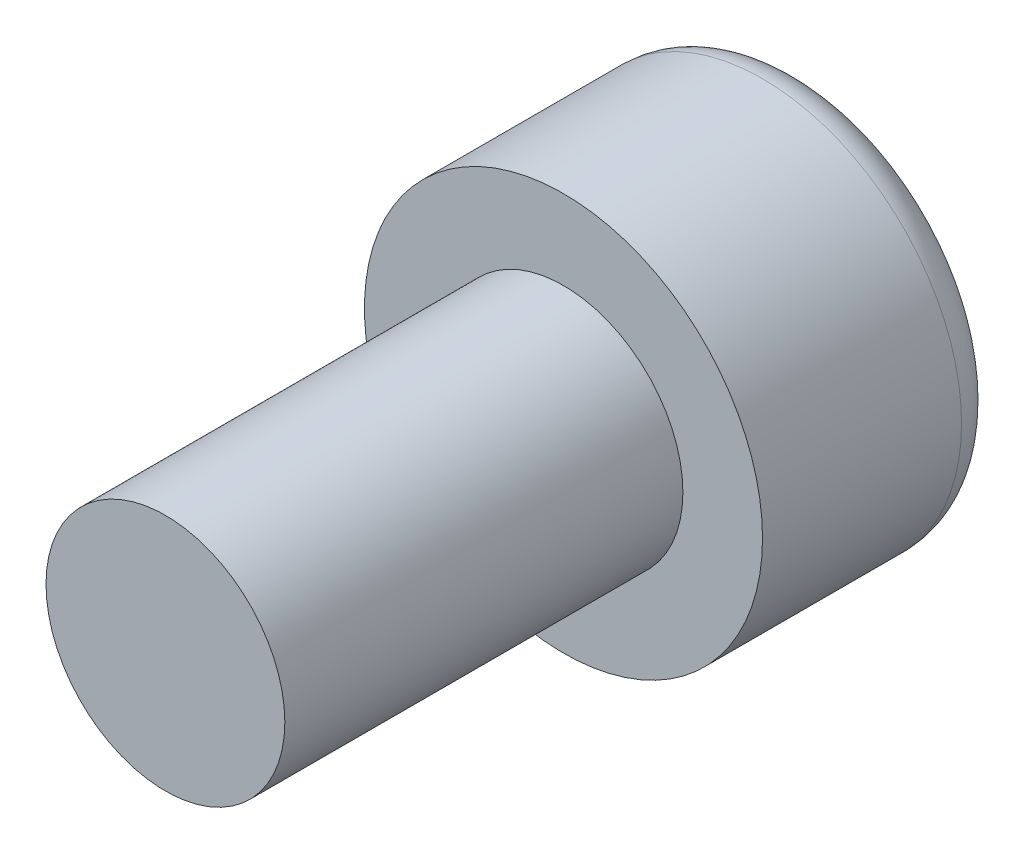
ISO-10303-21;
HEADER;
FILE_DESCRIPTION(('STEP AP214'),'2;1');
FILE_NAME('part.step','',(''),(''),'','','');
FILE_SCHEMA(('AUTOMOTIVE_DESIGN { 1 0 10303 214 1 1 1 1 }'));
ENDSEC;
DATA;
#1=APPLICATION_CONTEXT('core data for automotive mechanical design processes');
#2=APPLICATION_PROTOCOL_DEFINITION('international standard','automotive_design',2000,#1);
#3=PRODUCT_CONTEXT('',#1,'mechanical');
#4=PRODUCT('Part','Part','',(#3));
#5=PRODUCT_RELATED_PRODUCT_CATEGORY('part','',(#4));
#6=PRODUCT_DEFINITION_FORMATION('','',#4);
#7=PRODUCT_DEFINITION_CONTEXT('part definition',#1,'design');
#8=PRODUCT_DEFINITION('design','',#6,#7);
#9=PRODUCT_DEFINITION_SHAPE('','',#8);
#10=(LENGTH_UNIT() NAMED_UNIT(*) SI_UNIT(.MILLI.,.METRE.));
#11=(NAMED_UNIT(*) PLANE_ANGLE_UNIT() SI_UNIT($,.RADIAN.));
#12=(NAMED_UNIT(*) SI_UNIT($,.STERADIAN.) SOLID_ANGLE_UNIT());
#13=UNCERTAINTY_MEASURE_WITH_UNIT(LENGTH_MEASURE(1.E-05),#10,'distance_accuracy_value','');
#14=(GEOMETRIC_REPRESENTATION_CONTEXT(3) GLOBAL_UNCERTAINTY_ASSIGNED_CONTEXT((#13)) GLOBAL_UNIT_ASSIGNED_CONTEXT((#10,
#11,#12)) REPRESENTATION_CONTEXT('',''));
#15=CARTESIAN_POINT('',(0.,0.,0.));
#16=DIRECTION('',(0.,0.,1.));
#17=DIRECTION('',(1.,0.,0.));
#18=AXIS2_PLACEMENT_3D('',#15,#16,#17);
#19=CARTESIAN_POINT('',(0.,0.,6.));
#20=DIRECTION('',(0.,0.,-1.));
#21=DIRECTION('',(-1.,0.,0.));
#22=AXIS2_PLACEMENT_3D('',#19,#20,#21);
#23=CYLINDRICAL_SURFACE('',#22,5.);
#24=CARTESIAN_POINT('',(0.,0.,1.));
#25=DIRECTION('',(0.,0.,1.));
#26=DIRECTION('',(1.,0.,0.));
#27=AXIS2_PLACEMENT_3D('',#24,#25,#26);
#28=CIRCLE('',#27,5.);
#29=CARTESIAN_POINT('',(5.,0.,1.));
#30=VERTEX_POINT('',#29);
#31=EDGE_CURVE('E42',#30,#30,#28,.T.);
#32=ORIENTED_EDGE('',*,*,#31,.T.);
#33=EDGE_LOOP('',(#32));
#34=FACE_BOUND('',#33,.T.);
#35=CARTESIAN_POINT('',(0.,0.,6.));
#36=DIRECTION('',(0.,0.,1.));
#37=DIRECTION('',(1.,0.,0.));
#38=AXIS2_PLACEMENT_3D('',#35,#36,#37);
#39=CIRCLE('',#38,5.);
#40=CARTESIAN_POINT('',(5.,0.,6.));
#41=VERTEX_POINT('',#40);
#42=EDGE_CURVE('E144',#41,#41,#39,.T.);
#43=ORIENTED_EDGE('',*,*,#42,.F.);
#44=EDGE_LOOP('',(#43));
#45=FACE_BOUND('',#44,.T.);
#46=ADVANCED_FACE('F34',(#34,#45),#23,.T.);
#47=CARTESIAN_POINT('',(0.,0.,6.));
#48=DIRECTION('',(0.,0.,1.));
#49=DIRECTION('',(1.,0.,0.));
#50=AXIS2_PLACEMENT_3D('',#47,#48,#49);
#51=PLANE('',#50);
#52=CARTESIAN_POINT('',(0.,0.,6.));
#53=DIRECTION('',(0.,0.,1.));
#54=DIRECTION('',(1.,0.,0.));
#55=AXIS2_PLACEMENT_3D('',#52,#53,#54);
#56=CIRCLE('',#55,3.);
#57=CARTESIAN_POINT('',(3.,0.,6.));
#58=VERTEX_POINT('',#57);
#59=EDGE_CURVE('E145',#58,#58,#56,.T.);
#60=ORIENTED_EDGE('',*,*,#59,.F.);
#61=EDGE_LOOP('',(#60));
#62=FACE_BOUND('',#61,.T.);
#63=ORIENTED_EDGE('',*,*,#42,.T.);
#64=EDGE_LOOP('',(#63));
#65=FACE_BOUND('',#64,.T.);
#66=ADVANCED_FACE('F163',(#62,#65),#51,.T.);
#67=CARTESIAN_POINT('',(0.,0.,0.));
#68=DIRECTION('',(0.,0.,1.));
#69=DIRECTION('',(1.,0.,0.));
#70=AXIS2_PLACEMENT_3D('',#67,#68,#69);
#71=PLANE('',#70);
#72=CARTESIAN_POINT('',(0.,0.,0.));
#73=DIRECTION('',(0.,0.,1.));
#74=DIRECTION('',(1.,0.,0.));
#75=AXIS2_PLACEMENT_3D('',#72,#73,#74);
#76=CIRCLE('',#75,4.);
#77=CARTESIAN_POINT('',(4.,0.,0.));
#78=VERTEX_POINT('',#77);
#79=EDGE_CURVE('E11',#78,#78,#76,.F.);
#80=ORIENTED_EDGE('',*,*,#79,.T.);
#81=EDGE_LOOP('',(#80));
#82=FACE_BOUND('',#81,.T.);
#83=DIRECTION('',(-0.866025403784438,-0.5,0.));
#84=VECTOR('',#83,1.);
#85=CARTESIAN_POINT('',(2.5,-1.44337567297407,0.));
#86=LINE('',#85,#84);
#87=CARTESIAN_POINT('',(2.5,-1.44337567297407,0.));
#88=VERTEX_POINT('',#87);
#89=CARTESIAN_POINT('',(0.,-2.88675134594813,0.));
#90=VERTEX_POINT('',#89);
#91=EDGE_CURVE('E123',#88,#90,#86,.T.);
#92=ORIENTED_EDGE('',*,*,#91,.F.);
#93=DIRECTION('',(0.,-1.,0.));
#94=VECTOR('',#93,1.);
#95=CARTESIAN_POINT('',(2.5,1.44337567297406,0.));
#96=LINE('',#95,#94);
#97=CARTESIAN_POINT('',(2.5,1.44337567297406,0.));
#98=VERTEX_POINT('',#97);
#99=EDGE_CURVE('E49',#98,#88,#96,.T.);
#100=ORIENTED_EDGE('',*,*,#99,.F.);
#101=DIRECTION('',(0.866025403784439,-0.5,0.));
#102=VECTOR('',#101,1.);
#103=CARTESIAN_POINT('',(0.,2.88675134594813,0.));
#104=LINE('',#103,#102);
#105=CARTESIAN_POINT('',(0.,2.88675134594813,0.));
#106=VERTEX_POINT('',#105);
#107=EDGE_CURVE('E132',#106,#98,#104,.T.);
#108=ORIENTED_EDGE('',*,*,#107,.F.);
#109=DIRECTION('',(0.866025403784439,0.5,0.));
#110=VECTOR('',#109,1.);
#111=CARTESIAN_POINT('',(-2.5,1.44337567297407,0.));
#112=LINE('',#111,#110);
#113=CARTESIAN_POINT('',(-2.5,1.44337567297407,0.));
#114=VERTEX_POINT('',#113);
#115=EDGE_CURVE('E130',#114,#106,#112,.T.);
#116=ORIENTED_EDGE('',*,*,#115,.F.);
#117=DIRECTION('',(0.,1.,0.));
#118=VECTOR('',#117,1.);
#119=CARTESIAN_POINT('',(-2.5,-1.44337567297406,0.));
#120=LINE('',#119,#118);
#121=CARTESIAN_POINT('',(-2.5,-1.44337567297406,0.));
#122=VERTEX_POINT('',#121);
#123=EDGE_CURVE('E97',#122,#114,#120,.T.);
#124=ORIENTED_EDGE('',*,*,#123,.F.);
#125=DIRECTION('',(-0.866025403784439,0.5,0.));
#126=VECTOR('',#125,1.);
#127=CARTESIAN_POINT('',(0.,-2.88675134594813,0.));
#128=LINE('',#127,#126);
#129=EDGE_CURVE('E126',#90,#122,#128,.T.);
#130=ORIENTED_EDGE('',*,*,#129,.F.);
#131=EDGE_LOOP('',(#92,#100,#108,#116,#124,#130));
#132=FACE_BOUND('',#131,.T.);
#133=ADVANCED_FACE('F167',(#82,#132),#71,.F.);
#134=CARTESIAN_POINT('',(0.,0.,16.));
#135=DIRECTION('',(0.,0.,-1.));
#136=DIRECTION('',(-1.,0.,0.));
#137=AXIS2_PLACEMENT_3D('',#134,#135,#136);
#138=CYLINDRICAL_SURFACE('',#137,3.);
#139=CARTESIAN_POINT('',(0.,0.,16.));
#140=DIRECTION('',(0.,0.,1.));
#141=DIRECTION('',(1.,0.,0.));
#142=AXIS2_PLACEMENT_3D('',#139,#140,#141);
#143=CIRCLE('',#142,3.);
#144=CARTESIAN_POINT('',(3.,0.,16.));
#145=VERTEX_POINT('',#144);
#146=EDGE_CURVE('E136',#145,#145,#143,.T.);
#147=ORIENTED_EDGE('',*,*,#146,.F.);
#148=EDGE_LOOP('',(#147));
#149=FACE_BOUND('',#148,.T.);
#150=ORIENTED_EDGE('',*,*,#59,.T.);
#151=EDGE_LOOP('',(#150));
#152=FACE_BOUND('',#151,.T.);
#153=ADVANCED_FACE('F172',(#149,#152),#138,.T.);
#154=CARTESIAN_POINT('',(0.,0.,16.));
#155=DIRECTION('',(0.,0.,1.));
#156=DIRECTION('',(1.,0.,0.));
#157=AXIS2_PLACEMENT_3D('',#154,#155,#156);
#158=PLANE('',#157);
#159=ORIENTED_EDGE('',*,*,#146,.T.);
#160=EDGE_LOOP('',(#159));
#161=FACE_BOUND('',#160,.T.);
#162=ADVANCED_FACE('F177',(#161),#158,.T.);
#163=CARTESIAN_POINT('',(2.5,1.44337567297406,3.));
#164=DIRECTION('',(1.,0.,0.));
#165=DIRECTION('',(0.,0.,-1.));
#166=AXIS2_PLACEMENT_3D('',#163,#164,#165);
#167=PLANE('',#166);
#168=ORIENTED_EDGE('',*,*,#99,.T.);
#169=DIRECTION('',(0.,0.,-1.));
#170=VECTOR('',#169,1.);
#171=CARTESIAN_POINT('',(2.5,-1.44337567297407,3.));
#172=LINE('',#171,#170);
#173=CARTESIAN_POINT('',(2.5,-1.44337567297407,3.));
#174=VERTEX_POINT('',#173);
#175=EDGE_CURVE('E79',#174,#88,#172,.T.);
#176=ORIENTED_EDGE('',*,*,#175,.F.);
#177=DIRECTION('',(0.,-1.,0.));
#178=VECTOR('',#177,1.);
#179=CARTESIAN_POINT('',(2.5,1.44337567297406,3.));
#180=LINE('',#179,#178);
#181=CARTESIAN_POINT('',(2.5,1.44337567297406,3.));
#182=VERTEX_POINT('',#181);
#183=EDGE_CURVE('E134',#182,#174,#180,.T.);
#184=ORIENTED_EDGE('',*,*,#183,.F.);
#185=DIRECTION('',(0.,0.,-1.));
#186=VECTOR('',#185,1.);
#187=CARTESIAN_POINT('',(2.5,1.44337567297406,3.));
#188=LINE('',#187,#186);
#189=EDGE_CURVE('E57',#182,#98,#188,.T.);
#190=ORIENTED_EDGE('',*,*,#189,.T.);
#191=EDGE_LOOP('',(#168,#176,#184,#190));
#192=FACE_BOUND('',#191,.T.);
#193=ADVANCED_FACE('F181',(#192),#167,.F.);
#194=CARTESIAN_POINT('',(0.,2.88675134594813,3.));
#195=DIRECTION('',(0.5,0.866025403784439,0.));
#196=DIRECTION('',(-0.866025403784439,0.5,0.));
#197=AXIS2_PLACEMENT_3D('',#194,#195,#196);
#198=PLANE('',#197);
#199=ORIENTED_EDGE('',*,*,#107,.T.);
#200=ORIENTED_EDGE('',*,*,#189,.F.);
#201=DIRECTION('',(0.866025403784439,-0.5,0.));
#202=VECTOR('',#201,1.);
#203=CARTESIAN_POINT('',(0.,2.88675134594813,3.));
#204=LINE('',#203,#202);
#205=CARTESIAN_POINT('',(0.,2.88675134594813,3.));
#206=VERTEX_POINT('',#205);
#207=EDGE_CURVE('E109',#206,#182,#204,.T.);
#208=ORIENTED_EDGE('',*,*,#207,.F.);
#209=DIRECTION('',(0.,0.,-1.));
#210=VECTOR('',#209,1.);
#211=CARTESIAN_POINT('',(0.,2.88675134594813,3.));
#212=LINE('',#211,#210);
#213=EDGE_CURVE('E101',#206,#106,#212,.T.);
#214=ORIENTED_EDGE('',*,*,#213,.T.);
#215=EDGE_LOOP('',(#199,#200,#208,#214));
#216=FACE_BOUND('',#215,.T.);
#217=ADVANCED_FACE('F185',(#216),#198,.F.);
#218=CARTESIAN_POINT('',(-2.5,1.44337567297407,3.));
#219=DIRECTION('',(-0.5,0.866025403784439,0.));
#220=DIRECTION('',(-0.866025403784439,-0.5,0.));
#221=AXIS2_PLACEMENT_3D('',#218,#219,#220);
#222=PLANE('',#221);
#223=ORIENTED_EDGE('',*,*,#115,.T.);
#224=ORIENTED_EDGE('',*,*,#213,.F.);
#225=DIRECTION('',(0.866025403784439,0.5,0.));
#226=VECTOR('',#225,1.);
#227=CARTESIAN_POINT('',(-2.5,1.44337567297407,3.));
#228=LINE('',#227,#226);
#229=CARTESIAN_POINT('',(-2.5,1.44337567297407,3.));
#230=VERTEX_POINT('',#229);
#231=EDGE_CURVE('E105',#230,#206,#228,.T.);
#232=ORIENTED_EDGE('',*,*,#231,.F.);
#233=DIRECTION('',(0.,0.,-1.));
#234=VECTOR('',#233,1.);
#235=CARTESIAN_POINT('',(-2.5,1.44337567297407,3.));
#236=LINE('',#235,#234);
#237=EDGE_CURVE('E90',#230,#114,#236,.T.);
#238=ORIENTED_EDGE('',*,*,#237,.T.);
#239=EDGE_LOOP('',(#223,#224,#232,#238));
#240=FACE_BOUND('',#239,.T.);
#241=ADVANCED_FACE('F106',(#240),#222,.F.);
#242=CARTESIAN_POINT('',(-2.5,-1.44337567297406,3.));
#243=DIRECTION('',(-1.,0.,0.));
#244=DIRECTION('',(0.,0.,1.));
#245=AXIS2_PLACEMENT_3D('',#242,#243,#244);
#246=PLANE('',#245);
#247=ORIENTED_EDGE('',*,*,#123,.T.);
#248=ORIENTED_EDGE('',*,*,#237,.F.);
#249=DIRECTION('',(0.,1.,0.));
#250=VECTOR('',#249,1.);
#251=CARTESIAN_POINT('',(-2.5,-1.44337567297406,3.));
#252=LINE('',#251,#250);
#253=CARTESIAN_POINT('',(-2.5,-1.44337567297406,3.));
#254=VERTEX_POINT('',#253);
#255=EDGE_CURVE('E94',#254,#230,#252,.T.);
#256=ORIENTED_EDGE('',*,*,#255,.F.);
#257=DIRECTION('',(0.,0.,-1.));
#258=VECTOR('',#257,1.);
#259=CARTESIAN_POINT('',(-2.5,-1.44337567297406,3.));
#260=LINE('',#259,#258);
#261=EDGE_CURVE('E102',#254,#122,#260,.T.);
#262=ORIENTED_EDGE('',*,*,#261,.T.);
#263=EDGE_LOOP('',(#247,#248,#256,#262));
#264=FACE_BOUND('',#263,.T.);
#265=ADVANCED_FACE('F92',(#264),#246,.F.);
#266=CARTESIAN_POINT('',(0.,-2.88675134594813,3.));
#267=DIRECTION('',(-0.5,-0.866025403784438,0.));
#268=DIRECTION('',(0.866025403784439,-0.5,0.));
#269=AXIS2_PLACEMENT_3D('',#266,#267,#268);
#270=PLANE('',#269);
#271=ORIENTED_EDGE('',*,*,#129,.T.);
#272=ORIENTED_EDGE('',*,*,#261,.F.);
#273=DIRECTION('',(-0.866025403784439,0.5,0.));
#274=VECTOR('',#273,1.);
#275=CARTESIAN_POINT('',(0.,-2.88675134594813,3.));
#276=LINE('',#275,#274);
#277=CARTESIAN_POINT('',(0.,-2.88675134594813,3.));
#278=VERTEX_POINT('',#277);
#279=EDGE_CURVE('E115',#278,#254,#276,.T.);
#280=ORIENTED_EDGE('',*,*,#279,.F.);
#281=DIRECTION('',(0.,0.,-1.));
#282=VECTOR('',#281,1.);
#283=CARTESIAN_POINT('',(0.,-2.88675134594813,3.));
#284=LINE('',#283,#282);
#285=EDGE_CURVE('E139',#278,#90,#284,.T.);
#286=ORIENTED_EDGE('',*,*,#285,.T.);
#287=EDGE_LOOP('',(#271,#272,#280,#286));
#288=FACE_BOUND('',#287,.T.);
#289=ADVANCED_FACE('F188',(#288),#270,.F.);
#290=CARTESIAN_POINT('',(2.5,-1.44337567297407,3.));
#291=DIRECTION('',(0.5,-0.866025403784439,0.));
#292=DIRECTION('',(0.866025403784439,0.5,0.));
#293=AXIS2_PLACEMENT_3D('',#290,#291,#292);
#294=PLANE('',#293);
#295=ORIENTED_EDGE('',*,*,#91,.T.);
#296=ORIENTED_EDGE('',*,*,#285,.F.);
#297=DIRECTION('',(-0.866025403784438,-0.5,0.));
#298=VECTOR('',#297,1.);
#299=CARTESIAN_POINT('',(2.5,-1.44337567297407,3.));
#300=LINE('',#299,#298);
#301=EDGE_CURVE('E117',#174,#278,#300,.T.);
#302=ORIENTED_EDGE('',*,*,#301,.F.);
#303=ORIENTED_EDGE('',*,*,#175,.T.);
#304=EDGE_LOOP('',(#295,#296,#302,#303));
#305=FACE_BOUND('',#304,.T.);
#306=ADVANCED_FACE('F159',(#305),#294,.F.);
#307=CARTESIAN_POINT('',(0.,0.,3.));
#308=DIRECTION('',(0.,0.,-1.));
#309=DIRECTION('',(-1.,0.,0.));
#310=AXIS2_PLACEMENT_3D('',#307,#308,#309);
#311=PLANE('',#310);
#312=ORIENTED_EDGE('',*,*,#183,.T.);
#313=ORIENTED_EDGE('',*,*,#301,.T.);
#314=ORIENTED_EDGE('',*,*,#279,.T.);
#315=ORIENTED_EDGE('',*,*,#255,.T.);
#316=ORIENTED_EDGE('',*,*,#231,.T.);
#317=ORIENTED_EDGE('',*,*,#207,.T.);
#318=EDGE_LOOP('',(#312,#313,#314,#315,#316,#317));
#319=FACE_BOUND('',#318,.T.);
#320=ADVANCED_FACE('F112',(#319),#311,.T.);
#321=CARTESIAN_POINT('',(0.,0.,1.));
#322=DIRECTION('',(0.,0.,1.));
#323=DIRECTION('',(1.,0.,0.));
#324=AXIS2_PLACEMENT_3D('',#321,#322,#323);
#325=TOROIDAL_SURFACE('',#324,4.,1.);
#326=ORIENTED_EDGE('',*,*,#79,.F.);
#327=EDGE_LOOP('',(#326));
#328=FACE_BOUND('',#327,.T.);
#329=ORIENTED_EDGE('',*,*,#31,.F.);
#330=EDGE_LOOP('',(#329));
#331=FACE_BOUND('',#330,.T.);
#332=ADVANCED_FACE('F36',(#328,#331),#325,.T.);
#333=CLOSED_SHELL('',(#46,#66,#133,#153,#162,#193,#217,#241,#265,#289,#306,#320,#332));
#334=MANIFOLD_SOLID_BREP('B2',#333);
#335=ADVANCED_BREP_SHAPE_REPRESENTATION('',(#18,#334),#14);
#336=SHAPE_DEFINITION_REPRESENTATION(#9,#335);
ENDSEC;
END-ISO-10303-21;
